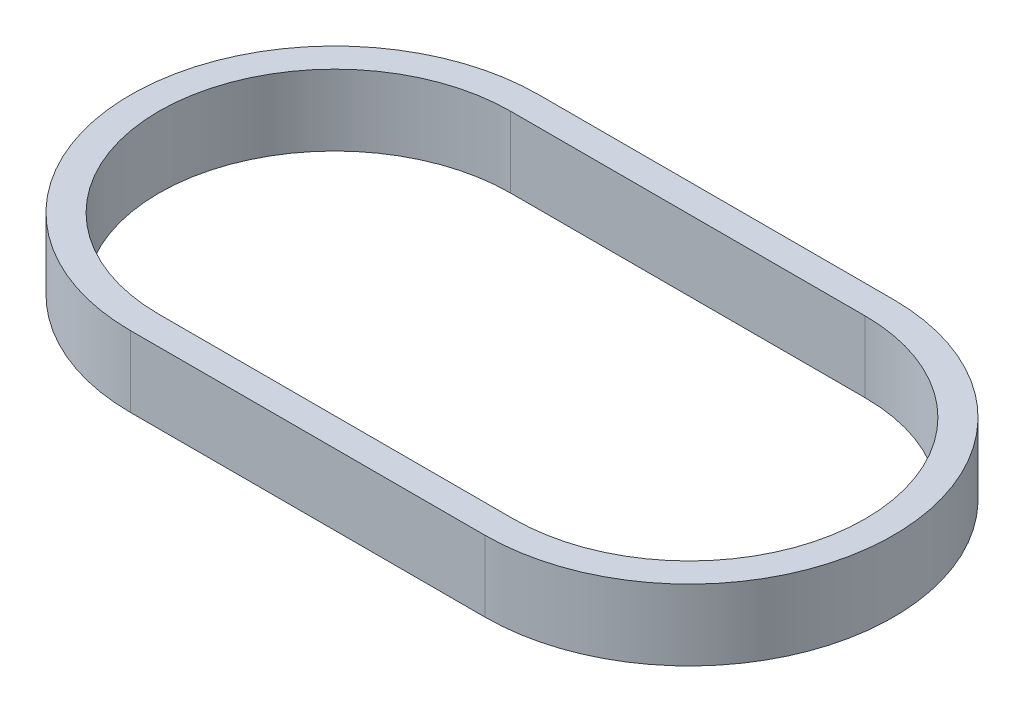
ISO-10303-21;
HEADER;
FILE_DESCRIPTION(('STEP AP214'),'2;1');
FILE_NAME('part.step','',(''),(''),'','','');
FILE_SCHEMA(('AUTOMOTIVE_DESIGN { 1 0 10303 214 1 1 1 1 }'));
ENDSEC;
DATA;
#1=APPLICATION_CONTEXT('core data for automotive mechanical design processes');
#2=APPLICATION_PROTOCOL_DEFINITION('international standard','automotive_design',2000,#1);
#3=PRODUCT_CONTEXT('',#1,'mechanical');
#4=PRODUCT('Part','Part','',(#3));
#5=PRODUCT_RELATED_PRODUCT_CATEGORY('part','',(#4));
#6=PRODUCT_DEFINITION_FORMATION('','',#4);
#7=PRODUCT_DEFINITION_CONTEXT('part definition',#1,'design');
#8=PRODUCT_DEFINITION('design','',#6,#7);
#9=PRODUCT_DEFINITION_SHAPE('','',#8);
#10=(LENGTH_UNIT() NAMED_UNIT(*) SI_UNIT(.MILLI.,.METRE.));
#11=(NAMED_UNIT(*) PLANE_ANGLE_UNIT() SI_UNIT($,.RADIAN.));
#12=(NAMED_UNIT(*) SI_UNIT($,.STERADIAN.) SOLID_ANGLE_UNIT());
#13=UNCERTAINTY_MEASURE_WITH_UNIT(LENGTH_MEASURE(1.E-05),#10,'distance_accuracy_value','');
#14=(GEOMETRIC_REPRESENTATION_CONTEXT(3) GLOBAL_UNCERTAINTY_ASSIGNED_CONTEXT((#13)) GLOBAL_UNIT_ASSIGNED_CONTEXT((#10,
#11,#12)) REPRESENTATION_CONTEXT('',''));
#15=CARTESIAN_POINT('',(0.,0.,0.));
#16=DIRECTION('',(0.,0.,1.));
#17=DIRECTION('',(1.,0.,0.));
#18=AXIS2_PLACEMENT_3D('',#15,#16,#17);
#19=CARTESIAN_POINT('',(0.,5.,0.));
#20=DIRECTION('',(0.,1.,0.));
#21=DIRECTION('',(0.,0.,1.));
#22=AXIS2_PLACEMENT_3D('',#19,#20,#21);
#23=PLANE('',#22);
#24=CARTESIAN_POINT('',(0.,5.,0.));
#25=DIRECTION('',(0.,1.,0.));
#26=DIRECTION('',(0.,0.,1.));
#27=AXIS2_PLACEMENT_3D('',#24,#25,#26);
#28=CIRCLE('',#27,14.4);
#29=CARTESIAN_POINT('',(0.,5.,-14.4));
#30=VERTEX_POINT('',#29);
#31=CARTESIAN_POINT('',(0.,5.,14.4));
#32=VERTEX_POINT('',#31);
#33=EDGE_CURVE('E153',#30,#32,#28,.T.);
#34=ORIENTED_EDGE('',*,*,#33,.T.);
#35=DIRECTION('',(1.,0.,0.));
#36=VECTOR('',#35,1.);
#37=CARTESIAN_POINT('',(0.,5.,14.4));
#38=LINE('',#37,#36);
#39=CARTESIAN_POINT('',(25.,5.,14.4));
#40=VERTEX_POINT('',#39);
#41=EDGE_CURVE('E157',#32,#40,#38,.T.);
#42=ORIENTED_EDGE('',*,*,#41,.T.);
#43=CARTESIAN_POINT('',(25.,5.,0.));
#44=DIRECTION('',(0.,1.,0.));
#45=DIRECTION('',(0.,0.,1.));
#46=AXIS2_PLACEMENT_3D('',#43,#44,#45);
#47=CIRCLE('',#46,14.4);
#48=CARTESIAN_POINT('',(25.,5.,-14.4));
#49=VERTEX_POINT('',#48);
#50=EDGE_CURVE('E161',#40,#49,#47,.T.);
#51=ORIENTED_EDGE('',*,*,#50,.T.);
#52=DIRECTION('',(-1.,0.,0.));
#53=VECTOR('',#52,1.);
#54=CARTESIAN_POINT('',(0.,5.,-14.4));
#55=LINE('',#54,#53);
#56=EDGE_CURVE('E164',#49,#30,#55,.T.);
#57=ORIENTED_EDGE('',*,*,#56,.T.);
#58=EDGE_LOOP('',(#34,#42,#51,#57));
#59=FACE_BOUND('',#58,.T.);
#60=DIRECTION('',(1.,0.,0.));
#61=VECTOR('',#60,1.);
#62=CARTESIAN_POINT('',(0.,5.,12.4));
#63=LINE('',#62,#61);
#64=CARTESIAN_POINT('',(0.,5.,12.4));
#65=VERTEX_POINT('',#64);
#66=CARTESIAN_POINT('',(25.,5.,12.4));
#67=VERTEX_POINT('',#66);
#68=EDGE_CURVE('E114',#65,#67,#63,.T.);
#69=ORIENTED_EDGE('',*,*,#68,.F.);
#70=CARTESIAN_POINT('',(0.,5.,0.));
#71=DIRECTION('',(0.,1.,0.));
#72=DIRECTION('',(0.,0.,1.));
#73=AXIS2_PLACEMENT_3D('',#70,#71,#72);
#74=CIRCLE('',#73,12.4);
#75=CARTESIAN_POINT('',(0.,5.,-12.4));
#76=VERTEX_POINT('',#75);
#77=EDGE_CURVE('E105',#76,#65,#74,.T.);
#78=ORIENTED_EDGE('',*,*,#77,.F.);
#79=DIRECTION('',(-1.,0.,0.));
#80=VECTOR('',#79,1.);
#81=CARTESIAN_POINT('',(0.,5.,-12.4));
#82=LINE('',#81,#80);
#83=CARTESIAN_POINT('',(25.,5.,-12.4));
#84=VERTEX_POINT('',#83);
#85=EDGE_CURVE('E131',#84,#76,#82,.T.);
#86=ORIENTED_EDGE('',*,*,#85,.F.);
#87=CARTESIAN_POINT('',(25.,5.,0.));
#88=DIRECTION('',(0.,1.,0.));
#89=DIRECTION('',(0.,0.,1.));
#90=AXIS2_PLACEMENT_3D('',#87,#88,#89);
#91=CIRCLE('',#90,12.4);
#92=EDGE_CURVE('E127',#67,#84,#91,.T.);
#93=ORIENTED_EDGE('',*,*,#92,.F.);
#94=EDGE_LOOP('',(#69,#78,#86,#93));
#95=FACE_BOUND('',#94,.T.);
#96=ADVANCED_FACE('F39',(#59,#95),#23,.T.);
#97=CARTESIAN_POINT('',(0.,0.,0.));
#98=DIRECTION('',(0.,1.,0.));
#99=DIRECTION('',(0.,0.,1.));
#100=AXIS2_PLACEMENT_3D('',#97,#98,#99);
#101=PLANE('',#100);
#102=CARTESIAN_POINT('',(0.,0.,0.));
#103=DIRECTION('',(0.,1.,0.));
#104=DIRECTION('',(0.,0.,1.));
#105=AXIS2_PLACEMENT_3D('',#102,#103,#104);
#106=CIRCLE('',#105,14.4);
#107=CARTESIAN_POINT('',(0.,0.,-14.4));
#108=VERTEX_POINT('',#107);
#109=CARTESIAN_POINT('',(0.,0.,14.4));
#110=VERTEX_POINT('',#109);
#111=EDGE_CURVE('E123',#108,#110,#106,.T.);
#112=ORIENTED_EDGE('',*,*,#111,.F.);
#113=DIRECTION('',(-1.,0.,0.));
#114=VECTOR('',#113,1.);
#115=CARTESIAN_POINT('',(0.,0.,-14.4));
#116=LINE('',#115,#114);
#117=CARTESIAN_POINT('',(25.,0.,-14.4));
#118=VERTEX_POINT('',#117);
#119=EDGE_CURVE('E158',#118,#108,#116,.T.);
#120=ORIENTED_EDGE('',*,*,#119,.F.);
#121=CARTESIAN_POINT('',(25.,0.,0.));
#122=DIRECTION('',(0.,1.,0.));
#123=DIRECTION('',(0.,0.,1.));
#124=AXIS2_PLACEMENT_3D('',#121,#122,#123);
#125=CIRCLE('',#124,14.4);
#126=CARTESIAN_POINT('',(25.,0.,14.4));
#127=VERTEX_POINT('',#126);
#128=EDGE_CURVE('E174',#127,#118,#125,.T.);
#129=ORIENTED_EDGE('',*,*,#128,.F.);
#130=DIRECTION('',(1.,0.,0.));
#131=VECTOR('',#130,1.);
#132=CARTESIAN_POINT('',(0.,0.,14.4));
#133=LINE('',#132,#131);
#134=EDGE_CURVE('E171',#110,#127,#133,.T.);
#135=ORIENTED_EDGE('',*,*,#134,.F.);
#136=EDGE_LOOP('',(#112,#120,#129,#135));
#137=FACE_BOUND('',#136,.T.);
#138=CARTESIAN_POINT('',(0.,0.,0.));
#139=DIRECTION('',(0.,1.,0.));
#140=DIRECTION('',(0.,0.,1.));
#141=AXIS2_PLACEMENT_3D('',#138,#139,#140);
#142=CIRCLE('',#141,12.4);
#143=CARTESIAN_POINT('',(0.,0.,-12.4));
#144=VERTEX_POINT('',#143);
#145=CARTESIAN_POINT('',(0.,0.,12.4));
#146=VERTEX_POINT('',#145);
#147=EDGE_CURVE('E63',#144,#146,#142,.T.);
#148=ORIENTED_EDGE('',*,*,#147,.T.);
#149=DIRECTION('',(1.,0.,0.));
#150=VECTOR('',#149,1.);
#151=CARTESIAN_POINT('',(0.,0.,12.4));
#152=LINE('',#151,#150);
#153=CARTESIAN_POINT('',(25.,0.,12.4));
#154=VERTEX_POINT('',#153);
#155=EDGE_CURVE('E121',#146,#154,#152,.T.);
#156=ORIENTED_EDGE('',*,*,#155,.T.);
#157=CARTESIAN_POINT('',(25.,0.,0.));
#158=DIRECTION('',(0.,1.,0.));
#159=DIRECTION('',(0.,0.,1.));
#160=AXIS2_PLACEMENT_3D('',#157,#158,#159);
#161=CIRCLE('',#160,12.4);
#162=CARTESIAN_POINT('',(25.,0.,-12.4));
#163=VERTEX_POINT('',#162);
#164=EDGE_CURVE('E140',#154,#163,#161,.T.);
#165=ORIENTED_EDGE('',*,*,#164,.T.);
#166=DIRECTION('',(-1.,0.,0.));
#167=VECTOR('',#166,1.);
#168=CARTESIAN_POINT('',(0.,0.,-12.4));
#169=LINE('',#168,#167);
#170=EDGE_CURVE('E115',#163,#144,#169,.T.);
#171=ORIENTED_EDGE('',*,*,#170,.T.);
#172=EDGE_LOOP('',(#148,#156,#165,#171));
#173=FACE_BOUND('',#172,.T.);
#174=ADVANCED_FACE('F197',(#137,#173),#101,.F.);
#175=CARTESIAN_POINT('',(0.,5.,0.));
#176=DIRECTION('',(0.,-1.,0.));
#177=DIRECTION('',(0.,0.,-1.));
#178=AXIS2_PLACEMENT_3D('',#175,#176,#177);
#179=CYLINDRICAL_SURFACE('',#178,14.4);
#180=ORIENTED_EDGE('',*,*,#111,.T.);
#181=DIRECTION('',(0.,-1.,0.));
#182=VECTOR('',#181,1.);
#183=CARTESIAN_POINT('',(0.,5.,14.4));
#184=LINE('',#183,#182);
#185=EDGE_CURVE('E11',#32,#110,#184,.T.);
#186=ORIENTED_EDGE('',*,*,#185,.F.);
#187=ORIENTED_EDGE('',*,*,#33,.F.);
#188=DIRECTION('',(0.,-1.,0.));
#189=VECTOR('',#188,1.);
#190=CARTESIAN_POINT('',(0.,5.,-14.4));
#191=LINE('',#190,#189);
#192=EDGE_CURVE('E167',#30,#108,#191,.T.);
#193=ORIENTED_EDGE('',*,*,#192,.T.);
#194=EDGE_LOOP('',(#180,#186,#187,#193));
#195=FACE_BOUND('',#194,.T.);
#196=ADVANCED_FACE('F41',(#195),#179,.T.);
#197=CARTESIAN_POINT('',(0.,5.,14.4));
#198=DIRECTION('',(0.,0.,-1.));
#199=DIRECTION('',(-1.,0.,0.));
#200=AXIS2_PLACEMENT_3D('',#197,#198,#199);
#201=PLANE('',#200);
#202=ORIENTED_EDGE('',*,*,#134,.T.);
#203=DIRECTION('',(0.,-1.,0.));
#204=VECTOR('',#203,1.);
#205=CARTESIAN_POINT('',(25.,5.,14.4));
#206=LINE('',#205,#204);
#207=EDGE_CURVE('E48',#40,#127,#206,.T.);
#208=ORIENTED_EDGE('',*,*,#207,.F.);
#209=ORIENTED_EDGE('',*,*,#41,.F.);
#210=ORIENTED_EDGE('',*,*,#185,.T.);
#211=EDGE_LOOP('',(#202,#208,#209,#210));
#212=FACE_BOUND('',#211,.T.);
#213=ADVANCED_FACE('F207',(#212),#201,.F.);
#214=CARTESIAN_POINT('',(25.,5.,0.));
#215=DIRECTION('',(0.,-1.,0.));
#216=DIRECTION('',(0.,0.,-1.));
#217=AXIS2_PLACEMENT_3D('',#214,#215,#216);
#218=CYLINDRICAL_SURFACE('',#217,14.4);
#219=ORIENTED_EDGE('',*,*,#128,.T.);
#220=DIRECTION('',(0.,-1.,0.));
#221=VECTOR('',#220,1.);
#222=CARTESIAN_POINT('',(25.,5.,-14.4));
#223=LINE('',#222,#221);
#224=EDGE_CURVE('E182',#49,#118,#223,.T.);
#225=ORIENTED_EDGE('',*,*,#224,.F.);
#226=ORIENTED_EDGE('',*,*,#50,.F.);
#227=ORIENTED_EDGE('',*,*,#207,.T.);
#228=EDGE_LOOP('',(#219,#225,#226,#227));
#229=FACE_BOUND('',#228,.T.);
#230=ADVANCED_FACE('F191',(#229),#218,.T.);
#231=CARTESIAN_POINT('',(0.,5.,-14.4));
#232=DIRECTION('',(0.,0.,1.));
#233=DIRECTION('',(1.,0.,0.));
#234=AXIS2_PLACEMENT_3D('',#231,#232,#233);
#235=PLANE('',#234);
#236=ORIENTED_EDGE('',*,*,#119,.T.);
#237=ORIENTED_EDGE('',*,*,#192,.F.);
#238=ORIENTED_EDGE('',*,*,#56,.F.);
#239=ORIENTED_EDGE('',*,*,#224,.T.);
#240=EDGE_LOOP('',(#236,#237,#238,#239));
#241=FACE_BOUND('',#240,.T.);
#242=ADVANCED_FACE('F201',(#241),#235,.F.);
#243=CARTESIAN_POINT('',(0.,5.,0.));
#244=DIRECTION('',(0.,-1.,0.));
#245=DIRECTION('',(0.,0.,-1.));
#246=AXIS2_PLACEMENT_3D('',#243,#244,#245);
#247=CYLINDRICAL_SURFACE('',#246,12.4);
#248=ORIENTED_EDGE('',*,*,#147,.F.);
#249=DIRECTION('',(0.,-1.,0.));
#250=VECTOR('',#249,1.);
#251=CARTESIAN_POINT('',(0.,5.,-12.4));
#252=LINE('',#251,#250);
#253=EDGE_CURVE('E109',#76,#144,#252,.T.);
#254=ORIENTED_EDGE('',*,*,#253,.F.);
#255=ORIENTED_EDGE('',*,*,#77,.T.);
#256=DIRECTION('',(0.,-1.,0.));
#257=VECTOR('',#256,1.);
#258=CARTESIAN_POINT('',(0.,5.,12.4));
#259=LINE('',#258,#257);
#260=EDGE_CURVE('E108',#65,#146,#259,.T.);
#261=ORIENTED_EDGE('',*,*,#260,.T.);
#262=EDGE_LOOP('',(#248,#254,#255,#261));
#263=FACE_BOUND('',#262,.T.);
#264=ADVANCED_FACE('F107',(#263),#247,.F.);
#265=CARTESIAN_POINT('',(0.,5.,12.4));
#266=DIRECTION('',(0.,0.,-1.));
#267=DIRECTION('',(-1.,0.,0.));
#268=AXIS2_PLACEMENT_3D('',#265,#266,#267);
#269=PLANE('',#268);
#270=ORIENTED_EDGE('',*,*,#155,.F.);
#271=ORIENTED_EDGE('',*,*,#260,.F.);
#272=ORIENTED_EDGE('',*,*,#68,.T.);
#273=DIRECTION('',(0.,-1.,0.));
#274=VECTOR('',#273,1.);
#275=CARTESIAN_POINT('',(25.,5.,12.4));
#276=LINE('',#275,#274);
#277=EDGE_CURVE('E124',#67,#154,#276,.T.);
#278=ORIENTED_EDGE('',*,*,#277,.T.);
#279=EDGE_LOOP('',(#270,#271,#272,#278));
#280=FACE_BOUND('',#279,.T.);
#281=ADVANCED_FACE('F118',(#280),#269,.T.);
#282=CARTESIAN_POINT('',(25.,5.,0.));
#283=DIRECTION('',(0.,-1.,0.));
#284=DIRECTION('',(0.,0.,-1.));
#285=AXIS2_PLACEMENT_3D('',#282,#283,#284);
#286=CYLINDRICAL_SURFACE('',#285,12.4);
#287=ORIENTED_EDGE('',*,*,#164,.F.);
#288=ORIENTED_EDGE('',*,*,#277,.F.);
#289=ORIENTED_EDGE('',*,*,#92,.T.);
#290=DIRECTION('',(0.,-1.,0.));
#291=VECTOR('',#290,1.);
#292=CARTESIAN_POINT('',(25.,5.,-12.4));
#293=LINE('',#292,#291);
#294=EDGE_CURVE('E55',#84,#163,#293,.T.);
#295=ORIENTED_EDGE('',*,*,#294,.T.);
#296=EDGE_LOOP('',(#287,#288,#289,#295));
#297=FACE_BOUND('',#296,.T.);
#298=ADVANCED_FACE('F230',(#297),#286,.F.);
#299=CARTESIAN_POINT('',(0.,5.,-12.4));
#300=DIRECTION('',(0.,0.,1.));
#301=DIRECTION('',(1.,0.,0.));
#302=AXIS2_PLACEMENT_3D('',#299,#300,#301);
#303=PLANE('',#302);
#304=ORIENTED_EDGE('',*,*,#170,.F.);
#305=ORIENTED_EDGE('',*,*,#294,.F.);
#306=ORIENTED_EDGE('',*,*,#85,.T.);
#307=ORIENTED_EDGE('',*,*,#253,.T.);
#308=EDGE_LOOP('',(#304,#305,#306,#307));
#309=FACE_BOUND('',#308,.T.);
#310=ADVANCED_FACE('F234',(#309),#303,.T.);
#311=CLOSED_SHELL('',(#96,#174,#196,#213,#230,#242,#264,#281,#298,#310));
#312=MANIFOLD_SOLID_BREP('B2',#311);
#313=ADVANCED_BREP_SHAPE_REPRESENTATION('',(#18,#312),#14);
#314=SHAPE_DEFINITION_REPRESENTATION(#9,#313);
ENDSEC;
END-ISO-10303-21;
